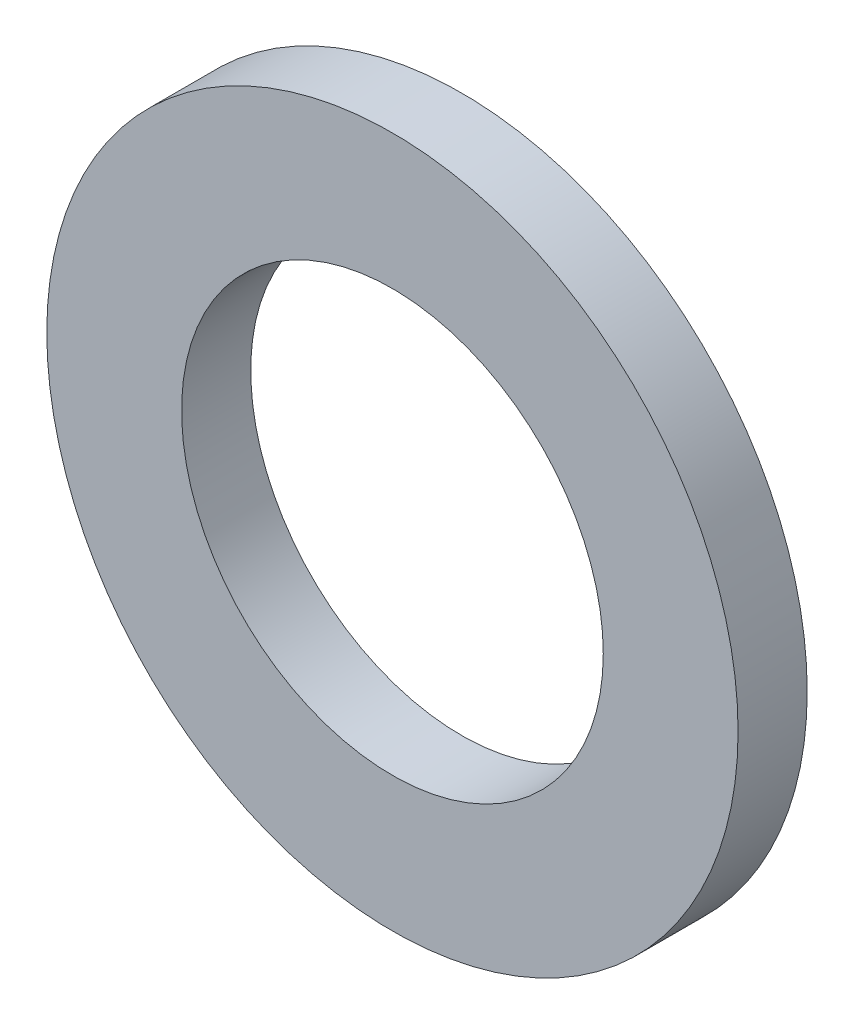
ISO-10303-21;
HEADER;
FILE_DESCRIPTION(('STEP AP214'),'2;1');
FILE_NAME('part.step','',(''),(''),'','','');
FILE_SCHEMA(('AUTOMOTIVE_DESIGN { 1 0 10303 214 1 1 1 1 }'));
ENDSEC;
DATA;
#1=APPLICATION_CONTEXT('core data for automotive mechanical design processes');
#2=APPLICATION_PROTOCOL_DEFINITION('international standard','automotive_design',2000,#1);
#3=PRODUCT_CONTEXT('',#1,'mechanical');
#4=PRODUCT('Part','Part','',(#3));
#5=PRODUCT_RELATED_PRODUCT_CATEGORY('part','',(#4));
#6=PRODUCT_DEFINITION_FORMATION('','',#4);
#7=PRODUCT_DEFINITION_CONTEXT('part definition',#1,'design');
#8=PRODUCT_DEFINITION('design','',#6,#7);
#9=PRODUCT_DEFINITION_SHAPE('','',#8);
#10=(LENGTH_UNIT() NAMED_UNIT(*) SI_UNIT(.MILLI.,.METRE.));
#11=(NAMED_UNIT(*) PLANE_ANGLE_UNIT() SI_UNIT($,.RADIAN.));
#12=(NAMED_UNIT(*) SI_UNIT($,.STERADIAN.) SOLID_ANGLE_UNIT());
#13=UNCERTAINTY_MEASURE_WITH_UNIT(LENGTH_MEASURE(1.E-05),#10,'distance_accuracy_value','');
#14=(GEOMETRIC_REPRESENTATION_CONTEXT(3) GLOBAL_UNCERTAINTY_ASSIGNED_CONTEXT((#13)) GLOBAL_UNIT_ASSIGNED_CONTEXT((#10,
#11,#12)) REPRESENTATION_CONTEXT('',''));
#15=CARTESIAN_POINT('',(0.,0.,0.));
#16=DIRECTION('',(0.,0.,1.));
#17=DIRECTION('',(1.,0.,0.));
#18=AXIS2_PLACEMENT_3D('',#15,#16,#17);
#19=CARTESIAN_POINT('',(0.,0.,1.));
#20=DIRECTION('',(0.,0.,1.));
#21=DIRECTION('',(1.,0.,0.));
#22=AXIS2_PLACEMENT_3D('',#19,#20,#21);
#23=PLANE('',#22);
#24=CARTESIAN_POINT('',(0.,0.,1.));
#25=DIRECTION('',(0.,0.,1.));
#26=DIRECTION('',(1.,0.,0.));
#27=AXIS2_PLACEMENT_3D('',#24,#25,#26);
#28=CIRCLE('',#27,5.);
#29=CARTESIAN_POINT('',(5.,0.,1.));
#30=VERTEX_POINT('',#29);
#31=EDGE_CURVE('E10',#30,#30,#28,.T.);
#32=ORIENTED_EDGE('',*,*,#31,.T.);
#33=EDGE_LOOP('',(#32));
#34=FACE_BOUND('',#33,.T.);
#35=CARTESIAN_POINT('',(0.,0.,1.));
#36=DIRECTION('',(0.,0.,1.));
#37=DIRECTION('',(1.,0.,0.));
#38=AXIS2_PLACEMENT_3D('',#35,#36,#37);
#39=CIRCLE('',#38,3.05);
#40=CARTESIAN_POINT('',(3.05,0.,1.));
#41=VERTEX_POINT('',#40);
#42=EDGE_CURVE('E50',#41,#41,#39,.T.);
#43=ORIENTED_EDGE('',*,*,#42,.F.);
#44=EDGE_LOOP('',(#43));
#45=FACE_BOUND('',#44,.T.);
#46=ADVANCED_FACE('F37',(#34,#45),#23,.T.);
#47=CARTESIAN_POINT('',(0.,0.,0.));
#48=DIRECTION('',(0.,0.,1.));
#49=DIRECTION('',(1.,0.,0.));
#50=AXIS2_PLACEMENT_3D('',#47,#48,#49);
#51=PLANE('',#50);
#52=CARTESIAN_POINT('',(0.,0.,0.));
#53=DIRECTION('',(0.,0.,1.));
#54=DIRECTION('',(1.,0.,0.));
#55=AXIS2_PLACEMENT_3D('',#52,#53,#54);
#56=CIRCLE('',#55,5.);
#57=CARTESIAN_POINT('',(5.,0.,0.));
#58=VERTEX_POINT('',#57);
#59=EDGE_CURVE('E41',#58,#58,#56,.T.);
#60=ORIENTED_EDGE('',*,*,#59,.F.);
#61=EDGE_LOOP('',(#60));
#62=FACE_BOUND('',#61,.T.);
#63=CARTESIAN_POINT('',(0.,0.,0.));
#64=DIRECTION('',(0.,0.,1.));
#65=DIRECTION('',(1.,0.,0.));
#66=AXIS2_PLACEMENT_3D('',#63,#64,#65);
#67=CIRCLE('',#66,3.05);
#68=CARTESIAN_POINT('',(3.05,0.,0.));
#69=VERTEX_POINT('',#68);
#70=EDGE_CURVE('E52',#69,#69,#67,.T.);
#71=ORIENTED_EDGE('',*,*,#70,.T.);
#72=EDGE_LOOP('',(#71));
#73=FACE_BOUND('',#72,.T.);
#74=ADVANCED_FACE('F64',(#62,#73),#51,.F.);
#75=CARTESIAN_POINT('',(0.,0.,1.));
#76=DIRECTION('',(0.,0.,-1.));
#77=DIRECTION('',(-1.,0.,0.));
#78=AXIS2_PLACEMENT_3D('',#75,#76,#77);
#79=CYLINDRICAL_SURFACE('',#78,5.);
#80=ORIENTED_EDGE('',*,*,#31,.F.);
#81=EDGE_LOOP('',(#80));
#82=FACE_BOUND('',#81,.T.);
#83=ORIENTED_EDGE('',*,*,#59,.T.);
#84=EDGE_LOOP('',(#83));
#85=FACE_BOUND('',#84,.T.);
#86=ADVANCED_FACE('F39',(#82,#85),#79,.T.);
#87=CARTESIAN_POINT('',(0.,0.,1.));
#88=DIRECTION('',(0.,0.,-1.));
#89=DIRECTION('',(-1.,0.,0.));
#90=AXIS2_PLACEMENT_3D('',#87,#88,#89);
#91=CYLINDRICAL_SURFACE('',#90,3.05);
#92=ORIENTED_EDGE('',*,*,#42,.T.);
#93=EDGE_LOOP('',(#92));
#94=FACE_BOUND('',#93,.T.);
#95=ORIENTED_EDGE('',*,*,#70,.F.);
#96=EDGE_LOOP('',(#95));
#97=FACE_BOUND('',#96,.T.);
#98=ADVANCED_FACE('F60',(#94,#97),#91,.F.);
#99=CLOSED_SHELL('',(#46,#74,#86,#98));
#100=MANIFOLD_SOLID_BREP('B2',#99);
#101=ADVANCED_BREP_SHAPE_REPRESENTATION('',(#18,#100),#14);
#102=SHAPE_DEFINITION_REPRESENTATION(#9,#101);
ENDSEC;
END-ISO-10303-21;
